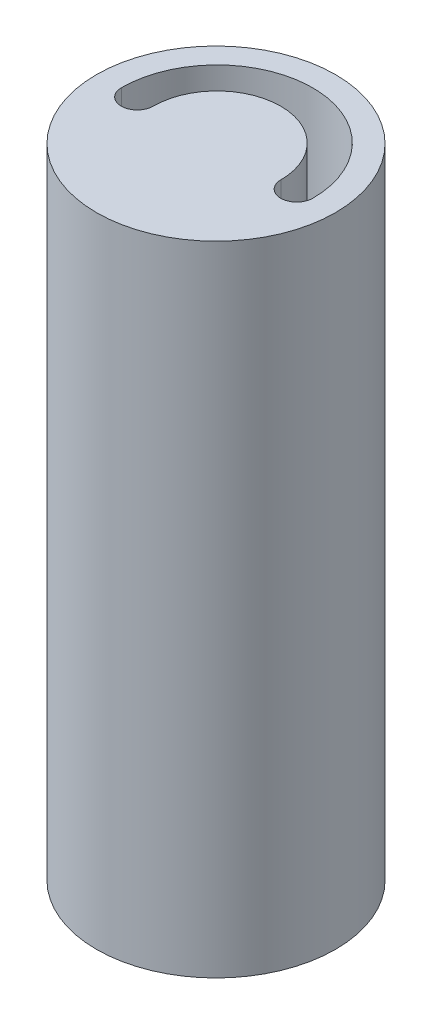
ISO-10303-21;
HEADER;
FILE_DESCRIPTION(('STEP AP214'),'2;1');
FILE_NAME('part.step','',(''),(''),'','','');
FILE_SCHEMA(('AUTOMOTIVE_DESIGN { 1 0 10303 214 1 1 1 1 }'));
ENDSEC;
DATA;
#1=APPLICATION_CONTEXT('core data for automotive mechanical design processes');
#2=APPLICATION_PROTOCOL_DEFINITION('international standard','automotive_design',2000,#1);
#3=PRODUCT_CONTEXT('',#1,'mechanical');
#4=PRODUCT('Part','Part','',(#3));
#5=PRODUCT_RELATED_PRODUCT_CATEGORY('part','',(#4));
#6=PRODUCT_DEFINITION_FORMATION('','',#4);
#7=PRODUCT_DEFINITION_CONTEXT('part definition',#1,'design');
#8=PRODUCT_DEFINITION('design','',#6,#7);
#9=PRODUCT_DEFINITION_SHAPE('','',#8);
#10=(LENGTH_UNIT() NAMED_UNIT(*) SI_UNIT(.MILLI.,.METRE.));
#11=(NAMED_UNIT(*) PLANE_ANGLE_UNIT() SI_UNIT($,.RADIAN.));
#12=(NAMED_UNIT(*) SI_UNIT($,.STERADIAN.) SOLID_ANGLE_UNIT());
#13=UNCERTAINTY_MEASURE_WITH_UNIT(LENGTH_MEASURE(1.E-05),#10,'distance_accuracy_value','');
#14=(GEOMETRIC_REPRESENTATION_CONTEXT(3) GLOBAL_UNCERTAINTY_ASSIGNED_CONTEXT((#13)) GLOBAL_UNIT_ASSIGNED_CONTEXT((#10,
#11,#12)) REPRESENTATION_CONTEXT('',''));
#15=CARTESIAN_POINT('',(0.,0.,0.));
#16=DIRECTION('',(0.,0.,1.));
#17=DIRECTION('',(1.,0.,0.));
#18=AXIS2_PLACEMENT_3D('',#15,#16,#17);
#19=CARTESIAN_POINT('',(0.,-349.6,-28.1));
#20=DIRECTION('',(0.,1.,0.));
#21=DIRECTION('',(0.,0.,1.));
#22=AXIS2_PLACEMENT_3D('',#19,#20,#21);
#23=CYLINDRICAL_SURFACE('',#22,28.1);
#24=CARTESIAN_POINT('',(0.,-28.1,-28.1));
#25=DIRECTION('',(0.,-1.,0.));
#26=DIRECTION('',(0.,0.,-1.));
#27=AXIS2_PLACEMENT_3D('',#24,#25,#26);
#28=CIRCLE('',#27,28.1);
#29=CARTESIAN_POINT('',(0.,-28.1,-56.2));
#30=VERTEX_POINT('',#29);
#31=EDGE_CURVE('E96',#30,#30,#28,.T.);
#32=ORIENTED_EDGE('',*,*,#31,.T.);
#33=EDGE_LOOP('',(#32));
#34=FACE_BOUND('',#33,.T.);
#35=CARTESIAN_POINT('',(0.,-178.1,-28.1));
#36=DIRECTION('',(0.,-1.,0.));
#37=DIRECTION('',(0.,0.,-1.));
#38=AXIS2_PLACEMENT_3D('',#35,#36,#37);
#39=CIRCLE('',#38,28.1);
#40=CARTESIAN_POINT('',(0.,-178.1,-56.2));
#41=VERTEX_POINT('',#40);
#42=EDGE_CURVE('E121',#41,#41,#39,.T.);
#43=ORIENTED_EDGE('',*,*,#42,.F.);
#44=EDGE_LOOP('',(#43));
#45=FACE_BOUND('',#44,.T.);
#46=ADVANCED_FACE('F39',(#34,#45),#23,.T.);
#47=CARTESIAN_POINT('',(0.,-349.6,-28.3320788958154));
#48=DIRECTION('',(0.,-1.,0.));
#49=DIRECTION('',(0.,0.,-1.));
#50=AXIS2_PLACEMENT_3D('',#47,#48,#49);
#51=CYLINDRICAL_SURFACE('',#50,15.);
#52=DIRECTION('',(0.,1.,0.));
#53=VECTOR('',#52,1.);
#54=CARTESIAN_POINT('',(15.,-349.6,-28.3320788958154));
#55=LINE('',#54,#53);
#56=CARTESIAN_POINT('',(15.,-178.1,-28.3320788958154));
#57=VERTEX_POINT('',#56);
#58=CARTESIAN_POINT('',(15.,-28.1,-28.3320788958154));
#59=VERTEX_POINT('',#58);
#60=EDGE_CURVE('E97',#57,#59,#55,.T.);
#61=ORIENTED_EDGE('',*,*,#60,.F.);
#62=CARTESIAN_POINT('',(0.,-178.1,-28.3320788958154));
#63=DIRECTION('',(0.,-1.,0.));
#64=DIRECTION('',(0.,0.,-1.));
#65=AXIS2_PLACEMENT_3D('',#62,#63,#64);
#66=CIRCLE('',#65,15.);
#67=CARTESIAN_POINT('',(-15.,-178.1,-28.3320788958154));
#68=VERTEX_POINT('',#67);
#69=EDGE_CURVE('E53',#57,#68,#66,.F.);
#70=ORIENTED_EDGE('',*,*,#69,.T.);
#71=DIRECTION('',(0.,1.,0.));
#72=VECTOR('',#71,1.);
#73=CARTESIAN_POINT('',(-15.,-349.6,-28.3320788958154));
#74=LINE('',#73,#72);
#75=CARTESIAN_POINT('',(-15.,-28.1,-28.3320788958154));
#76=VERTEX_POINT('',#75);
#77=EDGE_CURVE('E107',#68,#76,#74,.T.);
#78=ORIENTED_EDGE('',*,*,#77,.T.);
#79=CARTESIAN_POINT('',(0.,-28.1,-28.3320788958154));
#80=DIRECTION('',(0.,-1.,0.));
#81=DIRECTION('',(0.,0.,-1.));
#82=AXIS2_PLACEMENT_3D('',#79,#80,#81);
#83=CIRCLE('',#82,15.);
#84=EDGE_CURVE('E115',#59,#76,#83,.F.);
#85=ORIENTED_EDGE('',*,*,#84,.F.);
#86=EDGE_LOOP('',(#61,#70,#78,#85));
#87=FACE_BOUND('',#86,.T.);
#88=ADVANCED_FACE('F131',(#87),#51,.T.);
#89=CARTESIAN_POINT('',(0.,-349.6,-28.3320788958154));
#90=DIRECTION('',(0.,-1.,0.));
#91=DIRECTION('',(0.,0.,-1.));
#92=AXIS2_PLACEMENT_3D('',#89,#90,#91);
#93=CYLINDRICAL_SURFACE('',#92,22.5);
#94=DIRECTION('',(0.,-1.,0.));
#95=VECTOR('',#94,1.);
#96=CARTESIAN_POINT('',(-22.5,-349.6,-28.3320788958154));
#97=LINE('',#96,#95);
#98=CARTESIAN_POINT('',(-22.5,-28.1,-28.3320788958154));
#99=VERTEX_POINT('',#98);
#100=CARTESIAN_POINT('',(-22.5,-178.1,-28.3320788958154));
#101=VERTEX_POINT('',#100);
#102=EDGE_CURVE('E91',#99,#101,#97,.T.);
#103=ORIENTED_EDGE('',*,*,#102,.T.);
#104=CARTESIAN_POINT('',(0.,-178.1,-28.3320788958154));
#105=DIRECTION('',(0.,-1.,0.));
#106=DIRECTION('',(0.,0.,-1.));
#107=AXIS2_PLACEMENT_3D('',#104,#105,#106);
#108=CIRCLE('',#107,22.5);
#109=CARTESIAN_POINT('',(22.5,-178.1,-28.3320788958154));
#110=VERTEX_POINT('',#109);
#111=EDGE_CURVE('E80',#101,#110,#108,.T.);
#112=ORIENTED_EDGE('',*,*,#111,.T.);
#113=DIRECTION('',(0.,-1.,0.));
#114=VECTOR('',#113,1.);
#115=CARTESIAN_POINT('',(22.5,-349.6,-28.3320788958154));
#116=LINE('',#115,#114);
#117=CARTESIAN_POINT('',(22.5,-28.1000000000001,-28.3320788958154));
#118=VERTEX_POINT('',#117);
#119=EDGE_CURVE('E89',#118,#110,#116,.T.);
#120=ORIENTED_EDGE('',*,*,#119,.F.);
#121=CARTESIAN_POINT('',(0.,-28.1,-28.3320788958154));
#122=DIRECTION('',(0.,-1.,0.));
#123=DIRECTION('',(0.,0.,-1.));
#124=AXIS2_PLACEMENT_3D('',#121,#122,#123);
#125=CIRCLE('',#124,22.5);
#126=EDGE_CURVE('E61',#99,#118,#125,.T.);
#127=ORIENTED_EDGE('',*,*,#126,.F.);
#128=EDGE_LOOP('',(#103,#112,#120,#127));
#129=FACE_BOUND('',#128,.T.);
#130=ADVANCED_FACE('F88',(#129),#93,.F.);
#131=CARTESIAN_POINT('',(-18.75,-24.6,-28.3320788958154));
#132=DIRECTION('',(0.,-1.,0.));
#133=DIRECTION('',(0.,0.,-1.));
#134=AXIS2_PLACEMENT_3D('',#131,#132,#133);
#135=CYLINDRICAL_SURFACE('',#134,3.75);
#136=CARTESIAN_POINT('',(-18.75,-178.1,-28.3320788958154));
#137=DIRECTION('',(0.,-1.,0.));
#138=DIRECTION('',(0.,0.,-1.));
#139=AXIS2_PLACEMENT_3D('',#136,#137,#138);
#140=CIRCLE('',#139,3.75);
#141=EDGE_CURVE('E125',#101,#68,#140,.F.);
#142=ORIENTED_EDGE('',*,*,#141,.F.);
#143=ORIENTED_EDGE('',*,*,#102,.F.);
#144=CARTESIAN_POINT('',(-18.75,-28.1,-28.3320788958154));
#145=DIRECTION('',(0.,-1.,0.));
#146=DIRECTION('',(0.,0.,-1.));
#147=AXIS2_PLACEMENT_3D('',#144,#145,#146);
#148=CIRCLE('',#147,3.75);
#149=EDGE_CURVE('E111',#99,#76,#148,.F.);
#150=ORIENTED_EDGE('',*,*,#149,.T.);
#151=ORIENTED_EDGE('',*,*,#77,.F.);
#152=EDGE_LOOP('',(#142,#143,#150,#151));
#153=FACE_BOUND('',#152,.T.);
#154=ADVANCED_FACE('F134',(#153),#135,.F.);
#155=CARTESIAN_POINT('',(18.75,-24.6,-28.3320788958154));
#156=DIRECTION('',(0.,-1.,0.));
#157=DIRECTION('',(0.,0.,-1.));
#158=AXIS2_PLACEMENT_3D('',#155,#156,#157);
#159=CYLINDRICAL_SURFACE('',#158,3.75);
#160=CARTESIAN_POINT('',(18.75,-178.1,-28.3320788958154));
#161=DIRECTION('',(0.,-1.,0.));
#162=DIRECTION('',(0.,0.,-1.));
#163=AXIS2_PLACEMENT_3D('',#160,#161,#162);
#164=CIRCLE('',#163,3.75);
#165=EDGE_CURVE('E11',#57,#110,#164,.F.);
#166=ORIENTED_EDGE('',*,*,#165,.F.);
#167=ORIENTED_EDGE('',*,*,#60,.T.);
#168=CARTESIAN_POINT('',(18.75,-28.1,-28.3320788958154));
#169=DIRECTION('',(0.,-1.,0.));
#170=DIRECTION('',(0.,0.,-1.));
#171=AXIS2_PLACEMENT_3D('',#168,#169,#170);
#172=CIRCLE('',#171,3.75);
#173=EDGE_CURVE('E47',#59,#118,#172,.F.);
#174=ORIENTED_EDGE('',*,*,#173,.T.);
#175=ORIENTED_EDGE('',*,*,#119,.T.);
#176=EDGE_LOOP('',(#166,#167,#174,#175));
#177=FACE_BOUND('',#176,.T.);
#178=ADVANCED_FACE('F94',(#177),#159,.F.);
#179=CARTESIAN_POINT('',(28.1,-28.1,143.8));
#180=DIRECTION('',(0.,-1.,0.));
#181=DIRECTION('',(0.,0.,-1.));
#182=AXIS2_PLACEMENT_3D('',#179,#180,#181);
#183=PLANE('',#182);
#184=ORIENTED_EDGE('',*,*,#126,.T.);
#185=ORIENTED_EDGE('',*,*,#173,.F.);
#186=ORIENTED_EDGE('',*,*,#84,.T.);
#187=ORIENTED_EDGE('',*,*,#149,.F.);
#188=EDGE_LOOP('',(#184,#185,#186,#187));
#189=FACE_BOUND('',#188,.T.);
#190=ORIENTED_EDGE('',*,*,#31,.F.);
#191=EDGE_LOOP('',(#190));
#192=FACE_BOUND('',#191,.T.);
#193=ADVANCED_FACE('F135',(#189,#192),#183,.F.);
#194=CARTESIAN_POINT('',(0.,-178.1,-28.3320788958154));
#195=DIRECTION('',(0.,-1.,0.));
#196=DIRECTION('',(0.,0.,-1.));
#197=AXIS2_PLACEMENT_3D('',#194,#195,#196);
#198=PLANE('',#197);
#199=ORIENTED_EDGE('',*,*,#141,.T.);
#200=ORIENTED_EDGE('',*,*,#69,.F.);
#201=ORIENTED_EDGE('',*,*,#165,.T.);
#202=ORIENTED_EDGE('',*,*,#111,.F.);
#203=EDGE_LOOP('',(#199,#200,#201,#202));
#204=FACE_BOUND('',#203,.T.);
#205=ORIENTED_EDGE('',*,*,#42,.T.);
#206=EDGE_LOOP('',(#205));
#207=FACE_BOUND('',#206,.T.);
#208=ADVANCED_FACE('F78',(#204,#207),#198,.T.);
#209=CLOSED_SHELL('',(#46,#88,#130,#154,#178,#193,#208));
#210=MANIFOLD_SOLID_BREP('B2',#209);
#211=ADVANCED_BREP_SHAPE_REPRESENTATION('',(#18,#210),#14);
#212=SHAPE_DEFINITION_REPRESENTATION(#9,#211);
ENDSEC;
END-ISO-10303-21;
